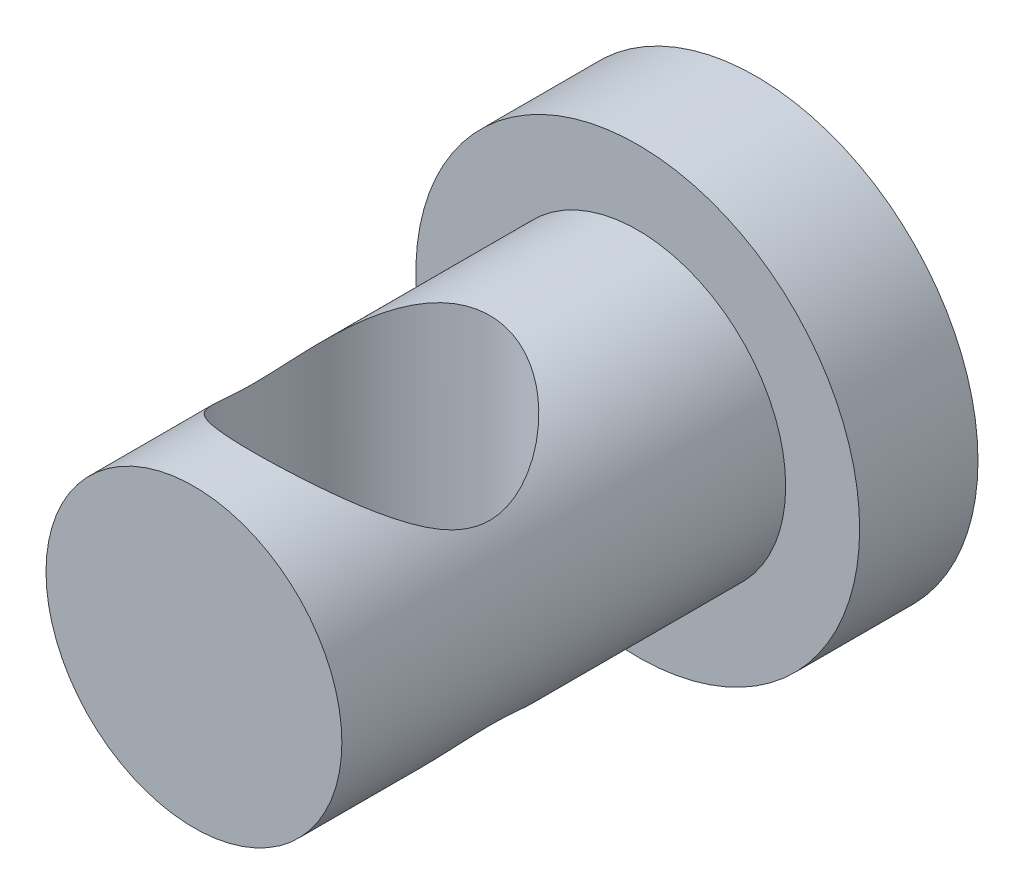
ISO-10303-21;
HEADER;
FILE_DESCRIPTION(('STEP AP214'),'2;1');
FILE_NAME('part.step','',(''),(''),'','','');
FILE_SCHEMA(('AUTOMOTIVE_DESIGN { 1 0 10303 214 1 1 1 1 }'));
ENDSEC;
DATA;
#1=APPLICATION_CONTEXT('core data for automotive mechanical design processes');
#2=APPLICATION_PROTOCOL_DEFINITION('international standard','automotive_design',2000,#1);
#3=PRODUCT_CONTEXT('',#1,'mechanical');
#4=PRODUCT('Part','Part','',(#3));
#5=PRODUCT_RELATED_PRODUCT_CATEGORY('part','',(#4));
#6=PRODUCT_DEFINITION_FORMATION('','',#4);
#7=PRODUCT_DEFINITION_CONTEXT('part definition',#1,'design');
#8=PRODUCT_DEFINITION('design','',#6,#7);
#9=PRODUCT_DEFINITION_SHAPE('','',#8);
#10=(LENGTH_UNIT() NAMED_UNIT(*) SI_UNIT(.MILLI.,.METRE.));
#11=(NAMED_UNIT(*) PLANE_ANGLE_UNIT() SI_UNIT($,.RADIAN.));
#12=(NAMED_UNIT(*) SI_UNIT($,.STERADIAN.) SOLID_ANGLE_UNIT());
#13=UNCERTAINTY_MEASURE_WITH_UNIT(LENGTH_MEASURE(1.E-05),#10,'distance_accuracy_value','');
#14=(GEOMETRIC_REPRESENTATION_CONTEXT(3) GLOBAL_UNCERTAINTY_ASSIGNED_CONTEXT((#13)) GLOBAL_UNIT_ASSIGNED_CONTEXT((#10,
#11,#12)) REPRESENTATION_CONTEXT('',''));
#15=CARTESIAN_POINT('',(0.,0.,0.));
#16=DIRECTION('',(0.,0.,1.));
#17=DIRECTION('',(1.,0.,0.));
#18=AXIS2_PLACEMENT_3D('',#15,#16,#17);
#19=CARTESIAN_POINT('',(0.,0.,4.));
#20=DIRECTION('',(0.,0.,-1.));
#21=DIRECTION('',(-1.,0.,0.));
#22=AXIS2_PLACEMENT_3D('',#19,#20,#21);
#23=CYLINDRICAL_SURFACE('',#22,7.5);
#24=CARTESIAN_POINT('',(0.,0.,4.));
#25=DIRECTION('',(0.,0.,1.));
#26=DIRECTION('',(1.,0.,0.));
#27=AXIS2_PLACEMENT_3D('',#24,#25,#26);
#28=CIRCLE('',#27,7.5);
#29=CARTESIAN_POINT('',(7.5,0.,4.));
#30=VERTEX_POINT('',#29);
#31=EDGE_CURVE('E49',#30,#30,#28,.T.);
#32=ORIENTED_EDGE('',*,*,#31,.F.);
#33=EDGE_LOOP('',(#32));
#34=FACE_BOUND('',#33,.T.);
#35=CARTESIAN_POINT('',(0.,0.,0.));
#36=DIRECTION('',(0.,0.,1.));
#37=DIRECTION('',(1.,0.,0.));
#38=AXIS2_PLACEMENT_3D('',#35,#36,#37);
#39=CIRCLE('',#38,7.5);
#40=CARTESIAN_POINT('',(7.5,0.,0.));
#41=VERTEX_POINT('',#40);
#42=EDGE_CURVE('E54',#41,#41,#39,.T.);
#43=ORIENTED_EDGE('',*,*,#42,.T.);
#44=EDGE_LOOP('',(#43));
#45=FACE_BOUND('',#44,.T.);
#46=ADVANCED_FACE('F37',(#34,#45),#23,.T.);
#47=CARTESIAN_POINT('',(0.,0.,4.));
#48=DIRECTION('',(0.,0.,1.));
#49=DIRECTION('',(1.,0.,0.));
#50=AXIS2_PLACEMENT_3D('',#47,#48,#49);
#51=PLANE('',#50);
#52=CARTESIAN_POINT('',(0.,0.,4.));
#53=DIRECTION('',(0.,0.,1.));
#54=DIRECTION('',(1.,0.,0.));
#55=AXIS2_PLACEMENT_3D('',#52,#53,#54);
#56=CIRCLE('',#55,5.);
#57=CARTESIAN_POINT('',(5.,0.,4.));
#58=VERTEX_POINT('',#57);
#59=EDGE_CURVE('E10',#58,#58,#56,.T.);
#60=ORIENTED_EDGE('',*,*,#59,.F.);
#61=EDGE_LOOP('',(#60));
#62=FACE_BOUND('',#61,.T.);
#63=ORIENTED_EDGE('',*,*,#31,.T.);
#64=EDGE_LOOP('',(#63));
#65=FACE_BOUND('',#64,.T.);
#66=ADVANCED_FACE('F85',(#62,#65),#51,.T.);
#67=CARTESIAN_POINT('',(0.,0.,0.));
#68=DIRECTION('',(0.,0.,1.));
#69=DIRECTION('',(1.,0.,0.));
#70=AXIS2_PLACEMENT_3D('',#67,#68,#69);
#71=PLANE('',#70);
#72=ORIENTED_EDGE('',*,*,#42,.F.);
#73=EDGE_LOOP('',(#72));
#74=FACE_BOUND('',#73,.T.);
#75=ADVANCED_FACE('F81',(#74),#71,.F.);
#76=CARTESIAN_POINT('',(0.,0.,19.));
#77=DIRECTION('',(0.,0.,-1.));
#78=DIRECTION('',(-1.,0.,0.));
#79=AXIS2_PLACEMENT_3D('',#76,#77,#78);
#80=CYLINDRICAL_SURFACE('',#79,5.);
#81=CARTESIAN_POINT('',(0.,-5.,17.));
#82=CARTESIAN_POINT('',(0.0960463892269615,-4.99999925007144,16.9999992323461));
#83=CARTESIAN_POINT('',(0.192107536101775,-4.99722609178681,16.9965342987154));
#84=CARTESIAN_POINT('',(0.383456997959251,-4.98619644135893,16.9827341812071));
#85=CARTESIAN_POINT('',(0.478744876926666,-4.97793704739464,16.9723953615393));
#86=CARTESIAN_POINT('',(0.667896097153801,-4.95610616327994,16.9450041169852));
#87=CARTESIAN_POINT('',(0.761756856675558,-4.94252601634641,16.9279407511002));
#88=CARTESIAN_POINT('',(0.947221840714973,-4.91036147054021,16.8873898130378));
#89=CARTESIAN_POINT('',(1.0388250210609,-4.89177480177176,16.8638993268064));
#90=CARTESIAN_POINT('',(1.30807557979516,-4.82935106483283,16.7846670057424));
#91=CARTESIAN_POINT('',(1.48159866642755,-4.77867586050698,16.7199489661262));
#92=CARTESIAN_POINT('',(1.81389737735533,-4.66270676226574,16.5697496440067));
#93=CARTESIAN_POINT('',(1.97267295492965,-4.59741282203946,16.4842682957271));
#94=CARTESIAN_POINT('',(2.2248639292531,-4.47912821132765,16.3263131354899));
#95=CARTESIAN_POINT('',(2.32274021976622,-4.42904400352648,16.2586526356544));
#96=CARTESIAN_POINT('',(2.51087921896427,-4.3251620211011,16.1159942660856));
#97=CARTESIAN_POINT('',(2.60114198151347,-4.2713642727544,16.0409964482704));
#98=CARTESIAN_POINT('',(2.77417073320715,-4.16107388762878,15.8840363254801));
#99=CARTESIAN_POINT('',(2.85691378598488,-4.10457375863138,15.8020540992062));
#100=CARTESIAN_POINT('',(3.01451382114098,-3.99026026433187,15.6317602016313));
#101=CARTESIAN_POINT('',(3.08937383375154,-3.93244741410357,15.5434509845157));
#102=CARTESIAN_POINT('',(3.23229007730866,-3.81587933402462,15.3592593681464));
#103=CARTESIAN_POINT('',(3.30022025313705,-3.75712363418718,15.2632794273615));
#104=CARTESIAN_POINT('',(3.42776995071922,-3.64112939088146,15.0650167525577));
#105=CARTESIAN_POINT('',(3.48738684516029,-3.58389133165285,14.9627320406525));
#106=CARTESIAN_POINT('',(3.59782503741137,-3.47300406561232,14.752072489208));
#107=CARTESIAN_POINT('',(3.64867015372864,-3.41934539082208,14.6437152350682));
#108=CARTESIAN_POINT('',(3.74117870293954,-3.31787465098284,14.4206173002951));
#109=CARTESIAN_POINT('',(3.78284998029722,-3.27005760650691,14.3058821793071));
#110=CARTESIAN_POINT('',(3.86171422877733,-3.17670210665408,14.052289573925));
#111=CARTESIAN_POINT('',(3.89730775139992,-3.1325716319431,13.9123893006908));
#112=CARTESIAN_POINT('',(3.95346969661508,-3.06140069934777,13.6255618867035));
#113=CARTESIAN_POINT('',(3.97407505769532,-3.03431824876937,13.4786529785159));
#114=CARTESIAN_POINT('',(3.99879637912877,-3.00168390937591,13.1796186687296));
#115=CARTESIAN_POINT('',(4.00276700147493,-2.99632180499322,13.0274589526052));
#116=CARTESIAN_POINT('',(3.99338954471176,-3.00879937970707,12.7245882920612));
#117=CARTESIAN_POINT('',(3.98002680850315,-3.02665869488164,12.5738786824653));
#118=CARTESIAN_POINT('',(3.93390695839724,-3.08641470165092,12.2555600051005));
#119=CARTESIAN_POINT('',(3.89843994454065,-3.13163820874367,12.0890012996781));
#120=CARTESIAN_POINT('',(3.80888715528761,-3.2399478268982,11.7669115175715));
#121=CARTESIAN_POINT('',(3.75474623305131,-3.30308674578671,11.611414767892));
#122=CARTESIAN_POINT('',(3.6459308316069,-3.42227632742623,11.3502162860134));
#123=CARTESIAN_POINT('',(3.59488537286135,-3.4760534543827,11.2418992113634));
#124=CARTESIAN_POINT('',(3.48415594475936,-3.58703185103079,11.0315509055288));
#125=CARTESIAN_POINT('',(3.42446798287778,-3.64423469607952,10.9295226107619));
#126=CARTESIAN_POINT('',(3.29671153239116,-3.76020626520278,10.7316127981893));
#127=CARTESIAN_POINT('',(3.22863333111247,-3.81897674116778,10.6357386033832));
#128=CARTESIAN_POINT('',(3.08431402129276,-3.93645333893041,10.4503326499681));
#129=CARTESIAN_POINT('',(3.00807425506497,-3.99515946971115,10.360799852417));
#130=CARTESIAN_POINT('',(2.84534419554464,-4.11270704931929,10.1859898764037));
#131=CARTESIAN_POINT('',(2.75863401138673,-4.17150999123005,10.1008909593902));
#132=CARTESIAN_POINT('',(2.5767399318482,-4.28625477779831,9.93808690624393));
#133=CARTESIAN_POINT('',(2.48155479066095,-4.34219619990715,9.8603828606315));
#134=CARTESIAN_POINT('',(2.28307653193499,-4.44974832295432,9.71324269462692));
#135=CARTESIAN_POINT('',(2.17980247969449,-4.50136864734376,9.6437880492184));
#136=CARTESIAN_POINT('',(1.96536649556132,-4.59904750487202,9.51387505848318));
#137=CARTESIAN_POINT('',(1.85420815715069,-4.64510854627346,9.45341265311521));
#138=CARTESIAN_POINT('',(1.57560055871032,-4.7484549444979,9.31891327628509));
#139=CARTESIAN_POINT('',(1.40425498615804,-4.80222795480343,9.24997790009987));
#140=CARTESIAN_POINT('',(1.13837354893346,-4.86955008764637,9.16427064786112));
#141=CARTESIAN_POINT('',(1.0482500423271,-4.88977064937689,9.13864746439657));
#142=CARTESIAN_POINT('',(0.86554055981691,-4.92539137425731,9.09363694172283));
#143=CARTESIAN_POINT('',(0.772955756713186,-4.94079379010376,9.07424668822554));
#144=CARTESIAN_POINT('',(0.585412597793529,-4.96651844615635,9.04191948907159));
#145=CARTESIAN_POINT('',(0.490443672775514,-4.97681103690024,9.0290202011283));
#146=CARTESIAN_POINT('',(0.299430031813113,-4.99194513088726,9.01006907630151));
#147=CARTESIAN_POINT('',(0.2033857736958,-4.99678887106583,9.00401442945879));
#148=CARTESIAN_POINT('',(0.0109789194594186,-5.00091325383537,8.99885810012436));
#149=CARTESIAN_POINT('',(-0.0853836963467236,-5.00019354569613,8.99975685598817));
#150=CARTESIAN_POINT('',(-0.277564076275652,-4.9932177293551,9.00848057793092));
#151=CARTESIAN_POINT('',(-0.373381868010185,-4.9869619042872,9.01630518980048));
#152=CARTESIAN_POINT('',(-0.643376202108295,-4.96153018407961,9.04817060146074));
#153=CARTESIAN_POINT('',(-0.816090326301507,-4.93592517140712,9.0802996845993));
#154=CARTESIAN_POINT('',(-1.15270281500896,-4.86835214152081,9.16574302748568));
#155=CARTESIAN_POINT('',(-1.31659854682906,-4.82637926825897,9.21906357444736));
#156=CARTESIAN_POINT('',(-1.64246254984512,-4.72579643945097,9.34830113405681));
#157=CARTESIAN_POINT('',(-1.80368475821042,-4.66631810673483,9.4254116772554));
#158=CARTESIAN_POINT('',(-2.11082248971803,-4.53567260245268,9.59772419791765));
#159=CARTESIAN_POINT('',(-2.25673724895786,-4.4645048479924,9.6929270775948));
#160=CARTESIAN_POINT('',(-2.55850389862999,-4.29987369953562,9.91844867329133));
#161=CARTESIAN_POINT('',(-2.71101415405667,-4.20473938172852,10.0520033927035));
#162=CARTESIAN_POINT('',(-2.99307397629789,-4.00886997355526,10.3387739133265));
#163=CARTESIAN_POINT('',(-3.12255559915959,-3.90811942507612,10.4920456681529));
#164=CARTESIAN_POINT('',(-3.31136973153524,-3.74748270315102,10.7528688898304));
#165=CARTESIAN_POINT('',(-3.3782748314895,-3.68709486880246,10.8547211888235));
#166=CARTESIAN_POINT('',(-3.50310004274981,-3.56870831535754,11.0652445154811));
#167=CARTESIAN_POINT('',(-3.5610153876826,-3.51071087553711,11.1739191177425));
#168=CARTESIAN_POINT('',(-3.6671754689768,-3.3996622702733,11.397778511532));
#169=CARTESIAN_POINT('',(-3.71545356957106,-3.34659439233028,11.512939008243));
#170=CARTESIAN_POINT('',(-3.80178930968628,-3.24818077497366,11.7500809901554));
#171=CARTESIAN_POINT('',(-3.83985955607521,-3.20282553589752,11.8720538348224));
#172=CARTESIAN_POINT('',(-3.90720331142187,-3.12038840866386,12.1321734224413));
#173=CARTESIAN_POINT('',(-3.9355911941399,-3.08419433480729,12.270845319615));
#174=CARTESIAN_POINT('',(-3.9775781127465,-3.02986743136531,12.5536752357157));
#175=CARTESIAN_POINT('',(-3.9912144566024,-3.01168904830204,12.6978184559051));
#176=CARTESIAN_POINT('',(-4.00264117924986,-2.99649473343137,12.9886973958438));
#177=CARTESIAN_POINT('',(-4.00034641568718,-2.9995925091774,13.135442858159));
#178=CARTESIAN_POINT('',(-3.97993037076082,-3.02661544312574,13.425968436275));
#179=CARTESIAN_POINT('',(-3.96178399745347,-3.05057362163063,13.5697434805944));
#180=CARTESIAN_POINT('',(-3.90415501142106,-3.12414149092463,13.8892133117397));
#181=CARTESIAN_POINT('',(-3.8601850138322,-3.17898498230062,14.0628451687517));
#182=CARTESIAN_POINT('',(-3.75216313748641,-3.3057783394867,14.3972679565639));
#183=CARTESIAN_POINT('',(-3.68805209792863,-3.37777844742743,14.5580192843807));
#184=CARTESIAN_POINT('',(-3.56189718857294,-3.50982146216505,14.8243502838134));
#185=CARTESIAN_POINT('',(-3.50405339937572,-3.56777397494363,14.9330247375901));
#186=CARTESIAN_POINT('',(-3.37929393177908,-3.6861580294968,15.1436809825488));
#187=CARTESIAN_POINT('',(-3.31237456346965,-3.74659057258538,15.2456600263806));
#188=CARTESIAN_POINT('',(-3.1696561642809,-3.8680845792066,15.4429727862888));
#189=CARTESIAN_POINT('',(-3.0938487432381,-3.92914658654706,15.5383000856413));
#190=CARTESIAN_POINT('',(-2.93352249741477,-4.05025163189584,15.7220037010828));
#191=CARTESIAN_POINT('',(-2.84900504963132,-4.11029482922852,15.8103811120198));
#192=CARTESIAN_POINT('',(-2.67014072502322,-4.2287118200936,15.980908248329));
#193=CARTESIAN_POINT('',(-2.57567862987889,-4.28705303147615,16.0629601482175));
#194=CARTESIAN_POINT('',(-2.37797638733423,-4.39979346035996,16.2188629924718));
#195=CARTESIAN_POINT('',(-2.27473478787953,-4.4541920230145,16.2927125755692));
#196=CARTESIAN_POINT('',(-2.05999159425819,-4.55747526770647,16.4311365724241));
#197=CARTESIAN_POINT('',(-1.94851057794575,-4.60637296519009,16.4957329833531));
#198=CARTESIAN_POINT('',(-1.71770987957306,-4.69732670360688,16.6147401044406));
#199=CARTESIAN_POINT('',(-1.59839505588521,-4.73938692977708,16.6691570485798));
#200=CARTESIAN_POINT('',(-1.31004257426744,-4.82841831850647,16.7835618155761));
#201=CARTESIAN_POINT('',(-1.13806652982954,-4.87206678940944,16.8389803627717));
#202=CARTESIAN_POINT('',(-0.873484823698024,-4.92393545570555,16.904524026571));
#203=CARTESIAN_POINT('',(-0.784257476388377,-4.93895148645559,16.9234336028542));
#204=CARTESIAN_POINT('',(-0.604069275434008,-4.96420704257136,16.9551797807482));
#205=CARTESIAN_POINT('',(-0.51310921224967,-4.97444869413617,16.9680190857005));
#206=CARTESIAN_POINT('',(-0.35177646010035,-4.98810319960311,16.9851213555989));
#207=CARTESIAN_POINT('',(-0.281625512428751,-4.99255849534678,16.9906948340961));
#208=CARTESIAN_POINT('',(-0.140985741127501,-4.99850750025309,16.9981348504333));
#209=CARTESIAN_POINT('',(-0.0704968458136411,-5.00000055043816,17.0000005634484));
#210=CARTESIAN_POINT('',(0.,-5.,17.));
#211=B_SPLINE_CURVE_WITH_KNOTS('',3,(#81,#82,#83,#84,#85,#86,#87,#88,#89,#90,#91,#92,#93,#94,
#95,#96,#97,#98,#99,#100,#101,#102,#103,#104,#105,#106,#107,#108,#109,#110,#111,#112,#113,#114,
#115,#116,#117,#118,#119,#120,#121,#122,#123,#124,#125,#126,#127,#128,#129,#130,#131,#132,#133,
#134,#135,#136,#137,#138,#139,#140,#141,#142,#143,#144,#145,#146,#147,#148,#149,#150,#151,#152,
#153,#154,#155,#156,#157,#158,#159,#160,#161,#162,#163,#164,#165,#166,#167,#168,#169,#170,#171,
#172,#173,#174,#175,#176,#177,#178,#179,#180,#181,#182,#183,#184,#185,#186,#187,#188,#189,#190,
#191,#192,#193,#194,#195,#196,#197,#198,#199,#200,#201,#202,#203,#204,#205,#206,#207,#208,#209,
#210),.UNSPECIFIED.,.T.,.F.,(4,2,2,2,2,2,2,2,2,2,2,2,2,2,2,2,2,2,2,2,2,2,2,2,2,2,2,2,2,2,2,2,2,
2,2,2,2,2,2,2,2,2,2,2,2,2,2,2,2,2,2,2,2,2,2,2,2,2,2,2,2,2,2,2,4),(0.,0.288062758667622,
0.576278003111146,0.864964129651048,1.15378136390405,1.72709009312658,2.30040063856698,
2.68722645474264,3.07404953396828,3.46201544535746,3.84983167444716,4.24376978737868,
4.63783211891323,5.03080698743563,5.42344451024556,5.87474837856561,6.32493619990523,
6.77904922175819,7.23354649231947,7.75923125238322,8.28648192165712,8.67980074282279,
9.07330184628003,9.46726282862532,9.86115911639956,10.2656076837238,10.6701158028798,
11.0736976518487,11.4770967247701,12.0514034064526,12.3386733158201,12.6258087123431,
12.9145912709401,13.2032552313199,13.4919373897649,13.7806047849779,14.3106110383656,
14.8407746547939,15.4037260006338,15.9667054266294,16.6361816844955,17.3076015388324,
17.7152021542886,18.1230181470313,18.5293968097803,18.9352712520426,19.3719136407629,
19.8074491211247,20.2453140663445,20.6838733784182,21.242737078473,21.8032579383456,
22.2109901693715,22.6188886741924,23.0271753760054,23.4353976291479,23.8490189589149,
24.2627088316334,24.675398328476,25.0878342578458,25.6427442660391,25.9197834242688,
26.1966990890726,26.4080865235327,26.6195209777157),.UNSPECIFIED.);
#212=CARTESIAN_POINT('',(0.,-5.,17.));
#213=VERTEX_POINT('',#212);
#214=EDGE_CURVE('E40',#213,#213,#211,.T.);
#215=ORIENTED_EDGE('',*,*,#214,.T.);
#216=EDGE_LOOP('',(#215));
#217=FACE_BOUND('',#216,.T.);
#218=CARTESIAN_POINT('',(0.,5.,17.));
#219=CARTESIAN_POINT('',(-0.0960463892269615,4.99999925007144,16.9999992323461));
#220=CARTESIAN_POINT('',(-0.192107536101775,4.99722609178681,16.9965342987154));
#221=CARTESIAN_POINT('',(-0.383456997959251,4.98619644135893,16.9827341812071));
#222=CARTESIAN_POINT('',(-0.478744876926666,4.97793704739464,16.9723953615393));
#223=CARTESIAN_POINT('',(-0.667896097153801,4.95610616327994,16.9450041169852));
#224=CARTESIAN_POINT('',(-0.761756856675558,4.94252601634641,16.9279407511002));
#225=CARTESIAN_POINT('',(-0.947221840714973,4.91036147054021,16.8873898130378));
#226=CARTESIAN_POINT('',(-1.0388250210609,4.89177480177176,16.8638993268064));
#227=CARTESIAN_POINT('',(-1.30807557979516,4.82935106483283,16.7846670057424));
#228=CARTESIAN_POINT('',(-1.48159866642755,4.77867586050698,16.7199489661262));
#229=CARTESIAN_POINT('',(-1.81389737735533,4.66270676226574,16.5697496440067));
#230=CARTESIAN_POINT('',(-1.97267295492965,4.59741282203946,16.4842682957271));
#231=CARTESIAN_POINT('',(-2.2248639292531,4.47912821132765,16.3263131354899));
#232=CARTESIAN_POINT('',(-2.32274021976622,4.42904400352648,16.2586526356544));
#233=CARTESIAN_POINT('',(-2.51087921896427,4.3251620211011,16.1159942660856));
#234=CARTESIAN_POINT('',(-2.60114198151347,4.2713642727544,16.0409964482704));
#235=CARTESIAN_POINT('',(-2.77417073320715,4.16107388762878,15.8840363254801));
#236=CARTESIAN_POINT('',(-2.85691378598488,4.10457375863138,15.8020540992062));
#237=CARTESIAN_POINT('',(-3.01451382114098,3.99026026433187,15.6317602016313));
#238=CARTESIAN_POINT('',(-3.08937383375154,3.93244741410357,15.5434509845157));
#239=CARTESIAN_POINT('',(-3.23229007730866,3.81587933402462,15.3592593681464));
#240=CARTESIAN_POINT('',(-3.30022025313705,3.75712363418718,15.2632794273615));
#241=CARTESIAN_POINT('',(-3.42776995071922,3.64112939088146,15.0650167525577));
#242=CARTESIAN_POINT('',(-3.48738684516029,3.58389133165285,14.9627320406525));
#243=CARTESIAN_POINT('',(-3.59782503741137,3.47300406561232,14.752072489208));
#244=CARTESIAN_POINT('',(-3.64867015372864,3.41934539082208,14.6437152350682));
#245=CARTESIAN_POINT('',(-3.74117870293954,3.31787465098284,14.4206173002951));
#246=CARTESIAN_POINT('',(-3.78284998029722,3.27005760650691,14.3058821793071));
#247=CARTESIAN_POINT('',(-3.86171422877733,3.17670210665408,14.052289573925));
#248=CARTESIAN_POINT('',(-3.89730775139992,3.1325716319431,13.9123893006908));
#249=CARTESIAN_POINT('',(-3.95346969661508,3.06140069934777,13.6255618867035));
#250=CARTESIAN_POINT('',(-3.97407505769532,3.03431824876937,13.4786529785159));
#251=CARTESIAN_POINT('',(-3.99879637912877,3.00168390937591,13.1796186687296));
#252=CARTESIAN_POINT('',(-4.00276700147493,2.99632180499322,13.0274589526052));
#253=CARTESIAN_POINT('',(-3.99338954471176,3.00879937970707,12.7245882920612));
#254=CARTESIAN_POINT('',(-3.98002680850315,3.02665869488164,12.5738786824653));
#255=CARTESIAN_POINT('',(-3.93390695839724,3.08641470165092,12.2555600051005));
#256=CARTESIAN_POINT('',(-3.89843994454065,3.13163820874367,12.0890012996781));
#257=CARTESIAN_POINT('',(-3.80888715528761,3.2399478268982,11.7669115175715));
#258=CARTESIAN_POINT('',(-3.75474623305131,3.30308674578671,11.611414767892));
#259=CARTESIAN_POINT('',(-3.6459308316069,3.42227632742623,11.3502162860134));
#260=CARTESIAN_POINT('',(-3.59488537286135,3.4760534543827,11.2418992113634));
#261=CARTESIAN_POINT('',(-3.48415594475936,3.58703185103079,11.0315509055288));
#262=CARTESIAN_POINT('',(-3.42446798287778,3.64423469607952,10.9295226107619));
#263=CARTESIAN_POINT('',(-3.29671153239116,3.76020626520278,10.7316127981893));
#264=CARTESIAN_POINT('',(-3.22863333111247,3.81897674116778,10.6357386033832));
#265=CARTESIAN_POINT('',(-3.08431402129276,3.93645333893041,10.4503326499681));
#266=CARTESIAN_POINT('',(-3.00807425506497,3.99515946971115,10.360799852417));
#267=CARTESIAN_POINT('',(-2.84534419554464,4.11270704931929,10.1859898764037));
#268=CARTESIAN_POINT('',(-2.75863401138673,4.17150999123005,10.1008909593902));
#269=CARTESIAN_POINT('',(-2.5767399318482,4.28625477779831,9.93808690624393));
#270=CARTESIAN_POINT('',(-2.48155479066095,4.34219619990715,9.8603828606315));
#271=CARTESIAN_POINT('',(-2.28307653193499,4.44974832295432,9.71324269462692));
#272=CARTESIAN_POINT('',(-2.17980247969449,4.50136864734376,9.6437880492184));
#273=CARTESIAN_POINT('',(-1.96536649556132,4.59904750487202,9.51387505848318));
#274=CARTESIAN_POINT('',(-1.85420815715069,4.64510854627346,9.45341265311521));
#275=CARTESIAN_POINT('',(-1.57560055871032,4.7484549444979,9.31891327628509));
#276=CARTESIAN_POINT('',(-1.40425498615804,4.80222795480343,9.24997790009987));
#277=CARTESIAN_POINT('',(-1.13837354893346,4.86955008764637,9.16427064786112));
#278=CARTESIAN_POINT('',(-1.0482500423271,4.88977064937689,9.13864746439657));
#279=CARTESIAN_POINT('',(-0.86554055981691,4.92539137425731,9.09363694172283));
#280=CARTESIAN_POINT('',(-0.772955756713186,4.94079379010376,9.07424668822554));
#281=CARTESIAN_POINT('',(-0.585412597793529,4.96651844615635,9.04191948907159));
#282=CARTESIAN_POINT('',(-0.490443672775514,4.97681103690024,9.0290202011283));
#283=CARTESIAN_POINT('',(-0.299430031813113,4.99194513088726,9.01006907630151));
#284=CARTESIAN_POINT('',(-0.2033857736958,4.99678887106583,9.00401442945879));
#285=CARTESIAN_POINT('',(-0.0109789194594186,5.00091325383537,8.99885810012436));
#286=CARTESIAN_POINT('',(0.0853836963467236,5.00019354569613,8.99975685598817));
#287=CARTESIAN_POINT('',(0.277564076275652,4.9932177293551,9.00848057793092));
#288=CARTESIAN_POINT('',(0.373381868010185,4.9869619042872,9.01630518980048));
#289=CARTESIAN_POINT('',(0.643376202108295,4.96153018407961,9.04817060146074));
#290=CARTESIAN_POINT('',(0.816090326301507,4.93592517140712,9.0802996845993));
#291=CARTESIAN_POINT('',(1.15270281500896,4.86835214152081,9.16574302748568));
#292=CARTESIAN_POINT('',(1.31659854682906,4.82637926825897,9.21906357444736));
#293=CARTESIAN_POINT('',(1.64246254984512,4.72579643945097,9.34830113405681));
#294=CARTESIAN_POINT('',(1.80368475821042,4.66631810673483,9.4254116772554));
#295=CARTESIAN_POINT('',(2.11082248971803,4.53567260245268,9.59772419791765));
#296=CARTESIAN_POINT('',(2.25673724895786,4.4645048479924,9.6929270775948));
#297=CARTESIAN_POINT('',(2.55850389862999,4.29987369953562,9.91844867329133));
#298=CARTESIAN_POINT('',(2.71101415405667,4.20473938172852,10.0520033927035));
#299=CARTESIAN_POINT('',(2.99307397629789,4.00886997355526,10.3387739133265));
#300=CARTESIAN_POINT('',(3.12255559915959,3.90811942507612,10.4920456681529));
#301=CARTESIAN_POINT('',(3.31136973153524,3.74748270315102,10.7528688898304));
#302=CARTESIAN_POINT('',(3.3782748314895,3.68709486880246,10.8547211888235));
#303=CARTESIAN_POINT('',(3.50310004274981,3.56870831535754,11.0652445154811));
#304=CARTESIAN_POINT('',(3.5610153876826,3.51071087553711,11.1739191177425));
#305=CARTESIAN_POINT('',(3.6671754689768,3.3996622702733,11.397778511532));
#306=CARTESIAN_POINT('',(3.71545356957106,3.34659439233028,11.512939008243));
#307=CARTESIAN_POINT('',(3.80178930968628,3.24818077497366,11.7500809901554));
#308=CARTESIAN_POINT('',(3.83985955607521,3.20282553589752,11.8720538348224));
#309=CARTESIAN_POINT('',(3.90720331142187,3.12038840866386,12.1321734224413));
#310=CARTESIAN_POINT('',(3.9355911941399,3.08419433480729,12.270845319615));
#311=CARTESIAN_POINT('',(3.9775781127465,3.02986743136531,12.5536752357157));
#312=CARTESIAN_POINT('',(3.9912144566024,3.01168904830204,12.6978184559051));
#313=CARTESIAN_POINT('',(4.00264117924986,2.99649473343137,12.9886973958438));
#314=CARTESIAN_POINT('',(4.00034641568718,2.9995925091774,13.135442858159));
#315=CARTESIAN_POINT('',(3.97993037076082,3.02661544312574,13.425968436275));
#316=CARTESIAN_POINT('',(3.96178399745347,3.05057362163063,13.5697434805944));
#317=CARTESIAN_POINT('',(3.90415501142106,3.12414149092463,13.8892133117397));
#318=CARTESIAN_POINT('',(3.8601850138322,3.17898498230062,14.0628451687517));
#319=CARTESIAN_POINT('',(3.75216313748641,3.3057783394867,14.3972679565639));
#320=CARTESIAN_POINT('',(3.68805209792863,3.37777844742743,14.5580192843807));
#321=CARTESIAN_POINT('',(3.56189718857294,3.50982146216505,14.8243502838134));
#322=CARTESIAN_POINT('',(3.50405339937572,3.56777397494363,14.9330247375901));
#323=CARTESIAN_POINT('',(3.37929393177908,3.6861580294968,15.1436809825488));
#324=CARTESIAN_POINT('',(3.31237456346965,3.74659057258538,15.2456600263806));
#325=CARTESIAN_POINT('',(3.1696561642809,3.8680845792066,15.4429727862888));
#326=CARTESIAN_POINT('',(3.0938487432381,3.92914658654706,15.5383000856413));
#327=CARTESIAN_POINT('',(2.93352249741477,4.05025163189584,15.7220037010828));
#328=CARTESIAN_POINT('',(2.84900504963132,4.11029482922852,15.8103811120198));
#329=CARTESIAN_POINT('',(2.67014072502322,4.2287118200936,15.980908248329));
#330=CARTESIAN_POINT('',(2.57567862987889,4.28705303147615,16.0629601482175));
#331=CARTESIAN_POINT('',(2.37797638733423,4.39979346035996,16.2188629924718));
#332=CARTESIAN_POINT('',(2.27473478787953,4.4541920230145,16.2927125755692));
#333=CARTESIAN_POINT('',(2.05999159425819,4.55747526770647,16.4311365724241));
#334=CARTESIAN_POINT('',(1.94851057794575,4.60637296519009,16.4957329833531));
#335=CARTESIAN_POINT('',(1.71770987957306,4.69732670360688,16.6147401044406));
#336=CARTESIAN_POINT('',(1.59839505588521,4.73938692977708,16.6691570485798));
#337=CARTESIAN_POINT('',(1.31004257426744,4.82841831850647,16.7835618155761));
#338=CARTESIAN_POINT('',(1.13806652982954,4.87206678940944,16.8389803627717));
#339=CARTESIAN_POINT('',(0.873484823698024,4.92393545570555,16.904524026571));
#340=CARTESIAN_POINT('',(0.784257476388377,4.93895148645559,16.9234336028542));
#341=CARTESIAN_POINT('',(0.604069275434008,4.96420704257136,16.9551797807482));
#342=CARTESIAN_POINT('',(0.51310921224967,4.97444869413617,16.9680190857005));
#343=CARTESIAN_POINT('',(0.35177646010035,4.98810319960311,16.9851213555989));
#344=CARTESIAN_POINT('',(0.281625512428751,4.99255849534678,16.9906948340961));
#345=CARTESIAN_POINT('',(0.140985741127501,4.99850750025309,16.9981348504333));
#346=CARTESIAN_POINT('',(0.0704968458136411,5.00000055043816,17.0000005634484));
#347=CARTESIAN_POINT('',(0.,5.,17.));
#348=B_SPLINE_CURVE_WITH_KNOTS('',3,(#218,#219,#220,#221,#222,#223,#224,#225,#226,#227,#228,
#229,#230,#231,#232,#233,#234,#235,#236,#237,#238,#239,#240,#241,#242,#243,#244,#245,#246,#247,
#248,#249,#250,#251,#252,#253,#254,#255,#256,#257,#258,#259,#260,#261,#262,#263,#264,#265,#266,
#267,#268,#269,#270,#271,#272,#273,#274,#275,#276,#277,#278,#279,#280,#281,#282,#283,#284,#285,
#286,#287,#288,#289,#290,#291,#292,#293,#294,#295,#296,#297,#298,#299,#300,#301,#302,#303,#304,
#305,#306,#307,#308,#309,#310,#311,#312,#313,#314,#315,#316,#317,#318,#319,#320,#321,#322,#323,
#324,#325,#326,#327,#328,#329,#330,#331,#332,#333,#334,#335,#336,#337,#338,#339,#340,#341,#342,
#343,#344,#345,#346,#347),.UNSPECIFIED.,.T.,.F.,(4,2,2,2,2,2,2,2,2,2,2,2,2,2,2,2,2,2,2,2,2,2,2,
2,2,2,2,2,2,2,2,2,2,2,2,2,2,2,2,2,2,2,2,2,2,2,2,2,2,2,2,2,2,2,2,2,2,2,2,2,2,2,2,2,4),(0.,
0.288062758667622,0.576278003111146,0.864964129651048,1.15378136390405,1.72709009312658,
2.30040063856698,2.68722645474264,3.07404953396828,3.46201544535746,3.84983167444716,
4.24376978737868,4.63783211891323,5.03080698743563,5.42344451024556,5.87474837856561,
6.32493619990523,6.77904922175819,7.23354649231947,7.75923125238322,8.28648192165712,
8.67980074282279,9.07330184628003,9.46726282862532,9.86115911639956,10.2656076837238,
10.6701158028798,11.0736976518487,11.4770967247701,12.0514034064526,12.3386733158201,
12.6258087123431,12.9145912709401,13.2032552313199,13.4919373897649,13.7806047849779,
14.3106110383656,14.8407746547939,15.4037260006338,15.9667054266294,16.6361816844955,
17.3076015388324,17.7152021542886,18.1230181470313,18.5293968097803,18.9352712520426,
19.3719136407629,19.8074491211247,20.2453140663445,20.6838733784182,21.242737078473,
21.8032579383456,22.2109901693715,22.6188886741924,23.0271753760054,23.4353976291479,
23.8490189589149,24.2627088316334,24.675398328476,25.0878342578458,25.6427442660391,
25.9197834242688,26.1966990890726,26.4080865235327,26.6195209777157),.UNSPECIFIED.);
#349=CARTESIAN_POINT('',(0.,5.,17.));
#350=VERTEX_POINT('',#349);
#351=EDGE_CURVE('E60',#350,#350,#348,.T.);
#352=ORIENTED_EDGE('',*,*,#351,.T.);
#353=EDGE_LOOP('',(#352));
#354=FACE_BOUND('',#353,.T.);
#355=CARTESIAN_POINT('',(0.,0.,19.));
#356=DIRECTION('',(0.,0.,1.));
#357=DIRECTION('',(1.,0.,0.));
#358=AXIS2_PLACEMENT_3D('',#355,#356,#357);
#359=CIRCLE('',#358,5.);
#360=CARTESIAN_POINT('',(5.,0.,19.));
#361=VERTEX_POINT('',#360);
#362=EDGE_CURVE('E57',#361,#361,#359,.T.);
#363=ORIENTED_EDGE('',*,*,#362,.F.);
#364=EDGE_LOOP('',(#363));
#365=FACE_BOUND('',#364,.T.);
#366=ORIENTED_EDGE('',*,*,#59,.T.);
#367=EDGE_LOOP('',(#366));
#368=FACE_BOUND('',#367,.T.);
#369=ADVANCED_FACE('F65',(#217,#354,#365,#368),#80,.T.);
#370=CARTESIAN_POINT('',(0.,0.,19.));
#371=DIRECTION('',(0.,0.,1.));
#372=DIRECTION('',(1.,0.,0.));
#373=AXIS2_PLACEMENT_3D('',#370,#371,#372);
#374=PLANE('',#373);
#375=ORIENTED_EDGE('',*,*,#362,.T.);
#376=EDGE_LOOP('',(#375));
#377=FACE_BOUND('',#376,.T.);
#378=ADVANCED_FACE('F72',(#377),#374,.T.);
#379=CARTESIAN_POINT('',(0.,-7.,13.));
#380=DIRECTION('',(0.,1.,0.));
#381=DIRECTION('',(0.,0.,1.));
#382=AXIS2_PLACEMENT_3D('',#379,#380,#381);
#383=CYLINDRICAL_SURFACE('',#382,4.);
#384=ORIENTED_EDGE('',*,*,#351,.F.);
#385=EDGE_LOOP('',(#384));
#386=FACE_BOUND('',#385,.T.);
#387=ORIENTED_EDGE('',*,*,#214,.F.);
#388=EDGE_LOOP('',(#387));
#389=FACE_BOUND('',#388,.T.);
#390=ADVANCED_FACE('F69',(#386,#389),#383,.F.);
#391=CLOSED_SHELL('',(#46,#66,#75,#369,#378,#390));
#392=MANIFOLD_SOLID_BREP('B2',#391);
#393=ADVANCED_BREP_SHAPE_REPRESENTATION('',(#18,#392),#14);
#394=SHAPE_DEFINITION_REPRESENTATION(#9,#393);
ENDSEC;
END-ISO-10303-21;
